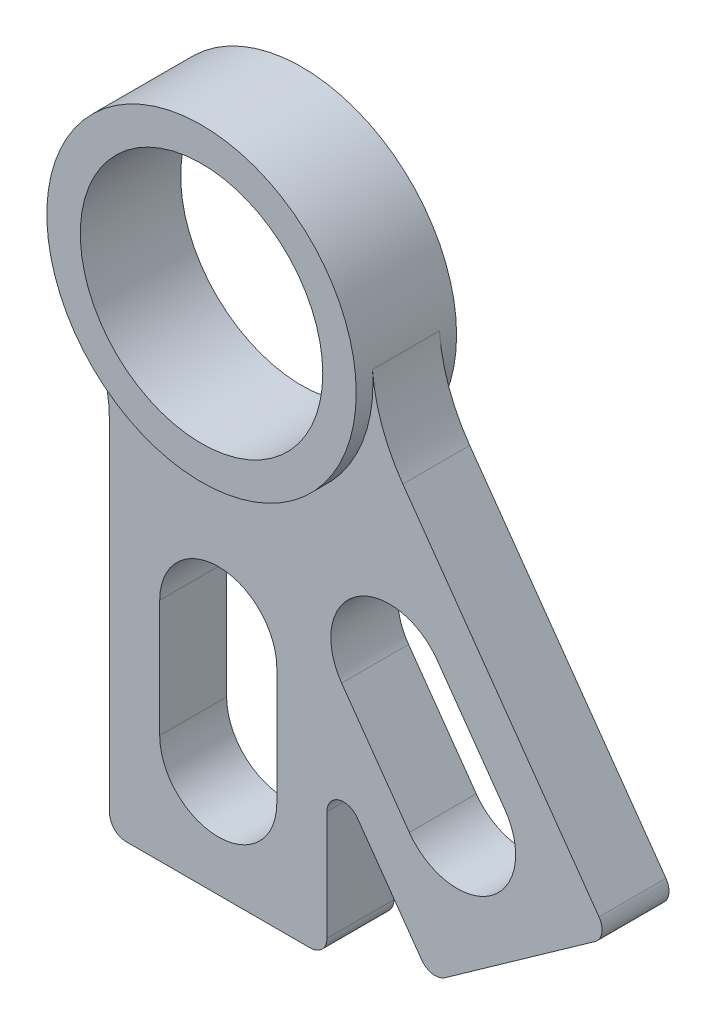
ISO-10303-21;
HEADER;
FILE_DESCRIPTION(('STEP AP214'),'2;1');
FILE_NAME('part.step','',(''),(''),'','','');
FILE_SCHEMA(('AUTOMOTIVE_DESIGN { 1 0 10303 214 1 1 1 1 }'));
ENDSEC;
DATA;
#1=APPLICATION_CONTEXT('core data for automotive mechanical design processes');
#2=APPLICATION_PROTOCOL_DEFINITION('international standard','automotive_design',2000,#1);
#3=PRODUCT_CONTEXT('',#1,'mechanical');
#4=PRODUCT('Part','Part','',(#3));
#5=PRODUCT_RELATED_PRODUCT_CATEGORY('part','',(#4));
#6=PRODUCT_DEFINITION_FORMATION('','',#4);
#7=PRODUCT_DEFINITION_CONTEXT('part definition',#1,'design');
#8=PRODUCT_DEFINITION('design','',#6,#7);
#9=PRODUCT_DEFINITION_SHAPE('','',#8);
#10=(LENGTH_UNIT() NAMED_UNIT(*) SI_UNIT(.MILLI.,.METRE.));
#11=(NAMED_UNIT(*) PLANE_ANGLE_UNIT() SI_UNIT($,.RADIAN.));
#12=(NAMED_UNIT(*) SI_UNIT($,.STERADIAN.) SOLID_ANGLE_UNIT());
#13=UNCERTAINTY_MEASURE_WITH_UNIT(LENGTH_MEASURE(1.E-05),#10,'distance_accuracy_value','');
#14=(GEOMETRIC_REPRESENTATION_CONTEXT(3) GLOBAL_UNCERTAINTY_ASSIGNED_CONTEXT((#13)) GLOBAL_UNIT_ASSIGNED_CONTEXT((#10,
#11,#12)) REPRESENTATION_CONTEXT('',''));
#15=CARTESIAN_POINT('',(0.,0.,0.));
#16=DIRECTION('',(0.,0.,1.));
#17=DIRECTION('',(1.,0.,0.));
#18=AXIS2_PLACEMENT_3D('',#15,#16,#17);
#19=CARTESIAN_POINT('',(0.,-27.9580697939255,-4.7625));
#20=DIRECTION('',(0.,0.,1.));
#21=DIRECTION('',(1.,0.,0.));
#22=AXIS2_PLACEMENT_3D('',#19,#20,#21);
#23=CYLINDRICAL_SURFACE('',#22,5.55624999999843);
#24=CARTESIAN_POINT('',(0.,-27.9580697939255,3.175));
#25=DIRECTION('',(0.,0.,1.));
#26=DIRECTION('',(1.,0.,0.));
#27=AXIS2_PLACEMENT_3D('',#24,#25,#26);
#28=CIRCLE('',#27,5.55624999999843);
#29=CARTESIAN_POINT('',(5.55624999999843,-27.9580697939256,3.175));
#30=VERTEX_POINT('',#29);
#31=CARTESIAN_POINT('',(-5.55624999999845,-27.9580697939256,3.175));
#32=VERTEX_POINT('',#31);
#33=EDGE_CURVE('E343',#30,#32,#28,.T.);
#34=ORIENTED_EDGE('',*,*,#33,.T.);
#35=DIRECTION('',(0.,0.,1.));
#36=VECTOR('',#35,1.);
#37=CARTESIAN_POINT('',(-5.55624999999843,-27.9580697939256,-4.7625));
#38=LINE('',#37,#36);
#39=CARTESIAN_POINT('',(-5.55624999999842,-27.9580697939256,-3.175));
#40=VERTEX_POINT('',#39);
#41=EDGE_CURVE('E242',#40,#32,#38,.T.);
#42=ORIENTED_EDGE('',*,*,#41,.F.);
#43=CARTESIAN_POINT('',(0.,-27.9580697939255,-3.175));
#44=DIRECTION('',(0.,0.,1.));
#45=DIRECTION('',(1.,0.,0.));
#46=AXIS2_PLACEMENT_3D('',#43,#44,#45);
#47=CIRCLE('',#46,5.55624999999843);
#48=CARTESIAN_POINT('',(5.55624999999841,-27.9580697939256,-3.175));
#49=VERTEX_POINT('',#48);
#50=EDGE_CURVE('E381',#49,#40,#47,.T.);
#51=ORIENTED_EDGE('',*,*,#50,.F.);
#52=DIRECTION('',(0.,0.,1.));
#53=VECTOR('',#52,1.);
#54=CARTESIAN_POINT('',(5.55624999999843,-27.9580697939256,-4.7625));
#55=LINE('',#54,#53);
#56=EDGE_CURVE('E213',#49,#30,#55,.T.);
#57=ORIENTED_EDGE('',*,*,#56,.T.);
#58=EDGE_LOOP('',(#34,#42,#51,#57));
#59=FACE_BOUND('',#58,.T.);
#60=ADVANCED_FACE('F39',(#59),#23,.F.);
#61=CARTESIAN_POINT('',(-5.55624999999844,0.,-4.7625));
#62=DIRECTION('',(1.,0.,0.));
#63=DIRECTION('',(0.,1.,0.));
#64=AXIS2_PLACEMENT_3D('',#61,#62,#63);
#65=PLANE('',#64);
#66=ORIENTED_EDGE('',*,*,#41,.T.);
#67=DIRECTION('',(0.,1.,0.));
#68=VECTOR('',#67,1.);
#69=CARTESIAN_POINT('',(-5.55624999999844,0.,3.175));
#70=LINE('',#69,#68);
#71=CARTESIAN_POINT('',(-5.55624999999848,-39.0705697939288,3.175));
#72=VERTEX_POINT('',#71);
#73=EDGE_CURVE('E349',#72,#32,#70,.T.);
#74=ORIENTED_EDGE('',*,*,#73,.F.);
#75=DIRECTION('',(0.,0.,1.));
#76=VECTOR('',#75,1.);
#77=CARTESIAN_POINT('',(-5.55624999999842,-39.0705697939288,-4.7625));
#78=LINE('',#77,#76);
#79=CARTESIAN_POINT('',(-5.55624999999842,-39.0705697939288,-3.175));
#80=VERTEX_POINT('',#79);
#81=EDGE_CURVE('E428',#80,#72,#78,.T.);
#82=ORIENTED_EDGE('',*,*,#81,.F.);
#83=DIRECTION('',(0.,-1.,0.));
#84=VECTOR('',#83,1.);
#85=CARTESIAN_POINT('',(-5.55624999999844,0.,-3.175));
#86=LINE('',#85,#84);
#87=EDGE_CURVE('E384',#40,#80,#86,.T.);
#88=ORIENTED_EDGE('',*,*,#87,.F.);
#89=EDGE_LOOP('',(#66,#74,#82,#88));
#90=FACE_BOUND('',#89,.T.);
#91=ADVANCED_FACE('F427',(#90),#65,.T.);
#92=CARTESIAN_POINT('',(0.,-39.0705697939288,-4.7625));
#93=DIRECTION('',(0.,0.,1.));
#94=DIRECTION('',(1.,0.,0.));
#95=AXIS2_PLACEMENT_3D('',#92,#93,#94);
#96=CYLINDRICAL_SURFACE('',#95,5.55624999999845);
#97=CARTESIAN_POINT('',(0.,-39.0705697939288,3.175));
#98=DIRECTION('',(0.,0.,1.));
#99=DIRECTION('',(1.,0.,0.));
#100=AXIS2_PLACEMENT_3D('',#97,#98,#99);
#101=CIRCLE('',#100,5.55624999999845);
#102=CARTESIAN_POINT('',(5.55624999999842,-39.0705697939288,3.175));
#103=VERTEX_POINT('',#102);
#104=EDGE_CURVE('E352',#72,#103,#101,.T.);
#105=ORIENTED_EDGE('',*,*,#104,.T.);
#106=DIRECTION('',(0.,0.,1.));
#107=VECTOR('',#106,1.);
#108=CARTESIAN_POINT('',(5.55624999999848,-39.0705697939288,-4.7625));
#109=LINE('',#108,#107);
#110=CARTESIAN_POINT('',(5.55624999999848,-39.0705697939288,-3.175));
#111=VERTEX_POINT('',#110);
#112=EDGE_CURVE('E217',#111,#103,#109,.T.);
#113=ORIENTED_EDGE('',*,*,#112,.F.);
#114=CARTESIAN_POINT('',(0.,-39.0705697939288,-3.175));
#115=DIRECTION('',(0.,0.,1.));
#116=DIRECTION('',(1.,0.,0.));
#117=AXIS2_PLACEMENT_3D('',#114,#115,#116);
#118=CIRCLE('',#117,5.55624999999845);
#119=EDGE_CURVE('E378',#80,#111,#118,.T.);
#120=ORIENTED_EDGE('',*,*,#119,.F.);
#121=ORIENTED_EDGE('',*,*,#81,.T.);
#122=EDGE_LOOP('',(#105,#113,#120,#121));
#123=FACE_BOUND('',#122,.T.);
#124=ADVANCED_FACE('F437',(#123),#96,.F.);
#125=CARTESIAN_POINT('',(16.2411710413153,-22.9127804627995,-4.7625));
#126=DIRECTION('',(0.,0.,1.));
#127=DIRECTION('',(1.,0.,0.));
#128=AXIS2_PLACEMENT_3D('',#125,#126,#127);
#129=CYLINDRICAL_SURFACE('',#128,5.55624999999839);
#130=CARTESIAN_POINT('',(16.241171041315,-22.9127804627991,3.175));
#131=DIRECTION('',(0.,0.,1.));
#132=DIRECTION('',(1.,0.,0.));
#133=AXIS2_PLACEMENT_3D('',#130,#131,#132);
#134=CIRCLE('',#133,5.5562499999984);
#135=CARTESIAN_POINT('',(20.7741537748646,-19.6996851327749,3.175));
#136=VERTEX_POINT('',#135);
#137=CARTESIAN_POINT('',(11.7081883077658,-26.1258757928238,3.175));
#138=VERTEX_POINT('',#137);
#139=EDGE_CURVE('E191',#136,#138,#134,.T.);
#140=ORIENTED_EDGE('',*,*,#139,.T.);
#141=DIRECTION('',(0.,0.,1.));
#142=VECTOR('',#141,1.);
#143=CARTESIAN_POINT('',(11.7081883077661,-26.1258757928242,-4.7625));
#144=LINE('',#143,#142);
#145=CARTESIAN_POINT('',(11.7081883077658,-26.1258757928238,-3.175));
#146=VERTEX_POINT('',#145);
#147=EDGE_CURVE('E205',#146,#138,#144,.T.);
#148=ORIENTED_EDGE('',*,*,#147,.F.);
#149=CARTESIAN_POINT('',(16.241171041315,-22.9127804627991,-3.175));
#150=DIRECTION('',(0.,0.,1.));
#151=DIRECTION('',(1.,0.,0.));
#152=AXIS2_PLACEMENT_3D('',#149,#150,#151);
#153=CIRCLE('',#152,5.5562499999984);
#154=CARTESIAN_POINT('',(20.7741537748643,-19.6996851327744,-3.175));
#155=VERTEX_POINT('',#154);
#156=EDGE_CURVE('E371',#155,#146,#153,.T.);
#157=ORIENTED_EDGE('',*,*,#156,.F.);
#158=DIRECTION('',(0.,0.,1.));
#159=VECTOR('',#158,1.);
#160=CARTESIAN_POINT('',(20.7741537748646,-19.6996851327749,-4.7625));
#161=LINE('',#160,#159);
#162=EDGE_CURVE('E207',#155,#136,#161,.T.);
#163=ORIENTED_EDGE('',*,*,#162,.T.);
#164=EDGE_LOOP('',(#140,#148,#157,#163));
#165=FACE_BOUND('',#164,.T.);
#166=ADVANCED_FACE('F203',(#165),#129,.F.);
#167=CARTESIAN_POINT('',(-4.53298273354924,-3.21309533002469,-4.7625));
#168=DIRECTION('',(0.815834912675017,0.578284873795388,0.));
#169=DIRECTION('',(-0.578284873795388,0.815834912675017,0.));
#170=AXIS2_PLACEMENT_3D('',#167,#168,#169);
#171=PLANE('',#170);
#172=ORIENTED_EDGE('',*,*,#147,.T.);
#173=DIRECTION('',(-0.578284873795389,0.815834912675016,0.));
#174=VECTOR('',#173,1.);
#175=CARTESIAN_POINT('',(-4.53298273354926,-3.2130953300247,3.175));
#176=LINE('',#175,#174);
#177=CARTESIAN_POINT('',(18.1343789678189,-35.1918412599276,3.175));
#178=VERTEX_POINT('',#177);
#179=EDGE_CURVE('E188',#178,#138,#176,.T.);
#180=ORIENTED_EDGE('',*,*,#179,.F.);
#181=DIRECTION('',(0.,0.,1.));
#182=VECTOR('',#181,1.);
#183=CARTESIAN_POINT('',(18.1343789678192,-35.191841259928,-4.7625));
#184=LINE('',#183,#182);
#185=CARTESIAN_POINT('',(18.1343789678189,-35.1918412599276,-3.175));
#186=VERTEX_POINT('',#185);
#187=EDGE_CURVE('E214',#186,#178,#184,.T.);
#188=ORIENTED_EDGE('',*,*,#187,.F.);
#189=DIRECTION('',(0.578284873795389,-0.815834912675016,0.));
#190=VECTOR('',#189,1.);
#191=CARTESIAN_POINT('',(-4.53298273354926,-3.2130953300247,-3.175));
#192=LINE('',#191,#190);
#193=EDGE_CURVE('E212',#146,#186,#192,.T.);
#194=ORIENTED_EDGE('',*,*,#193,.F.);
#195=EDGE_LOOP('',(#172,#180,#188,#194));
#196=FACE_BOUND('',#195,.T.);
#197=ADVANCED_FACE('F211',(#196),#171,.T.);
#198=CARTESIAN_POINT('',(22.6673617013684,-31.9787459299033,-4.7625));
#199=DIRECTION('',(0.,0.,1.));
#200=DIRECTION('',(1.,0.,0.));
#201=AXIS2_PLACEMENT_3D('',#198,#199,#200);
#202=CYLINDRICAL_SURFACE('',#201,5.55624999999839);
#203=CARTESIAN_POINT('',(22.6673617013681,-31.9787459299029,3.175));
#204=DIRECTION('',(0.,0.,1.));
#205=DIRECTION('',(1.,0.,0.));
#206=AXIS2_PLACEMENT_3D('',#203,#204,#205);
#207=CIRCLE('',#206,5.5562499999984);
#208=CARTESIAN_POINT('',(27.2003444349174,-28.7656505998782,3.175));
#209=VERTEX_POINT('',#208);
#210=EDGE_CURVE('E194',#178,#209,#207,.T.);
#211=ORIENTED_EDGE('',*,*,#210,.T.);
#212=DIRECTION('',(0.,0.,1.));
#213=VECTOR('',#212,1.);
#214=CARTESIAN_POINT('',(27.2003444349177,-28.7656505998786,-4.7625));
#215=LINE('',#214,#213);
#216=CARTESIAN_POINT('',(27.2003444349177,-28.7656505998786,-3.175));
#217=VERTEX_POINT('',#216);
#218=EDGE_CURVE('E219',#217,#209,#215,.T.);
#219=ORIENTED_EDGE('',*,*,#218,.F.);
#220=CARTESIAN_POINT('',(22.6673617013681,-31.9787459299029,-3.175));
#221=DIRECTION('',(0.,0.,1.));
#222=DIRECTION('',(1.,0.,0.));
#223=AXIS2_PLACEMENT_3D('',#220,#221,#222);
#224=CIRCLE('',#223,5.5562499999984);
#225=EDGE_CURVE('E407',#186,#217,#224,.T.);
#226=ORIENTED_EDGE('',*,*,#225,.F.);
#227=ORIENTED_EDGE('',*,*,#187,.T.);
#228=EDGE_LOOP('',(#211,#219,#226,#227));
#229=FACE_BOUND('',#228,.T.);
#230=ADVANCED_FACE('F461',(#229),#202,.F.);
#231=CARTESIAN_POINT('',(30.4686948801661,2.3108419978967,-4.7625));
#232=DIRECTION('',(0.,0.,1.));
#233=DIRECTION('',(1.,0.,0.));
#234=AXIS2_PLACEMENT_3D('',#231,#232,#233);
#235=CYLINDRICAL_SURFACE('',#234,15.8749999999984);
#236=DIRECTION('',(0.,0.,1.));
#237=VECTOR('',#236,1.);
#238=CARTESIAN_POINT('',(14.6391568085926,1.11027986266364,-4.7625));
#239=LINE('',#238,#237);
#240=CARTESIAN_POINT('',(14.6391568085926,1.11027986266361,-3.175));
#241=VERTEX_POINT('',#240);
#242=CARTESIAN_POINT('',(14.6391568085927,1.11027986266362,3.175));
#243=VERTEX_POINT('',#242);
#244=EDGE_CURVE('E226',#241,#243,#239,.T.);
#245=ORIENTED_EDGE('',*,*,#244,.T.);
#246=CARTESIAN_POINT('',(30.4686948801662,2.31084199789663,3.175));
#247=DIRECTION('',(0.,0.,1.));
#248=DIRECTION('',(1.,0.,0.));
#249=AXIS2_PLACEMENT_3D('',#246,#247,#248);
#250=CIRCLE('',#249,15.8749999999984);
#251=CARTESIAN_POINT('',(17.5173156414516,-6.86943037360423,3.175));
#252=VERTEX_POINT('',#251);
#253=EDGE_CURVE('E358',#243,#252,#250,.T.);
#254=ORIENTED_EDGE('',*,*,#253,.T.);
#255=DIRECTION('',(0.,0.,1.));
#256=VECTOR('',#255,1.);
#257=CARTESIAN_POINT('',(17.5173156414513,-6.86943037360393,-4.7625));
#258=LINE('',#257,#256);
#259=CARTESIAN_POINT('',(17.5173156414515,-6.86943037360424,-3.175));
#260=VERTEX_POINT('',#259);
#261=EDGE_CURVE('E229',#260,#252,#258,.T.);
#262=ORIENTED_EDGE('',*,*,#261,.F.);
#263=CARTESIAN_POINT('',(30.4686948801662,2.31084199789663,-3.175));
#264=DIRECTION('',(0.,0.,1.));
#265=DIRECTION('',(1.,0.,0.));
#266=AXIS2_PLACEMENT_3D('',#263,#264,#265);
#267=CIRCLE('',#266,15.8749999999984);
#268=EDGE_CURVE('E319',#241,#260,#267,.T.);
#269=ORIENTED_EDGE('',*,*,#268,.F.);
#270=EDGE_LOOP('',(#245,#254,#262,#269));
#271=FACE_BOUND('',#270,.T.);
#272=ADVANCED_FACE('F464',(#271),#235,.F.);
#273=CARTESIAN_POINT('',(8.41839650516398,5.96717704147522,-4.7625));
#274=DIRECTION('',(0.815834912675016,0.578284873795389,0.));
#275=DIRECTION('',(-0.578284873795389,0.815834912675016,0.));
#276=AXIS2_PLACEMENT_3D('',#273,#274,#275);
#277=PLANE('',#276);
#278=DIRECTION('',(0.578284873795388,-0.815834912675017,0.));
#279=VECTOR('',#278,1.);
#280=CARTESIAN_POINT('',(8.41839650516403,5.96717704147524,3.175));
#281=LINE('',#280,#279);
#282=CARTESIAN_POINT('',(36.1349080108575,-33.1348274697205,3.175));
#283=VERTEX_POINT('',#282);
#284=EDGE_CURVE('E712',#252,#283,#281,.T.);
#285=ORIENTED_EDGE('',*,*,#284,.T.);
#286=DIRECTION('',(0.,0.,1.));
#287=VECTOR('',#286,1.);
#288=CARTESIAN_POINT('',(36.1349080108575,-33.1348274697204,-4.7625));
#289=LINE('',#288,#287);
#290=CARTESIAN_POINT('',(36.1349080108575,-33.1348274697205,-3.175));
#291=VERTEX_POINT('',#290);
#292=EDGE_CURVE('E263',#283,#291,#289,.F.);
#293=ORIENTED_EDGE('',*,*,#292,.T.);
#294=DIRECTION('',(-0.578284873795388,0.815834912675017,0.));
#295=VECTOR('',#294,1.);
#296=CARTESIAN_POINT('',(8.41839650516403,5.96717704147524,-3.175));
#297=LINE('',#296,#295);
#298=EDGE_CURVE('E317',#291,#260,#297,.T.);
#299=ORIENTED_EDGE('',*,*,#298,.T.);
#300=ORIENTED_EDGE('',*,*,#261,.T.);
#301=EDGE_LOOP('',(#285,#293,#299,#300));
#302=FACE_BOUND('',#301,.T.);
#303=ADVANCED_FACE('F472',(#302),#277,.T.);
#304=CARTESIAN_POINT('',(28.6345387428437,-40.3971424350673,-4.7625));
#305=DIRECTION('',(0.578284873795389,-0.815834912675016,0.));
#306=DIRECTION('',(0.815834912675016,0.578284873795389,0.));
#307=AXIS2_PLACEMENT_3D('',#304,#305,#306);
#308=PLANE('',#307);
#309=DIRECTION('',(0.815834912675017,0.578284873795388,0.));
#310=VECTOR('',#309,1.);
#311=CARTESIAN_POINT('',(28.6345387428433,-40.3971424350669,-3.175));
#312=LINE('',#311,#310);
#313=CARTESIAN_POINT('',(21.5112801615509,-45.4462922393919,-3.175));
#314=VERTEX_POINT('',#313);
#315=CARTESIAN_POINT('',(35.7577973241358,-35.3479926307418,-3.175));
#316=VERTEX_POINT('',#315);
#317=EDGE_CURVE('E309',#314,#316,#312,.T.);
#318=ORIENTED_EDGE('',*,*,#317,.T.);
#319=DIRECTION('',(0.,0.,1.));
#320=VECTOR('',#319,1.);
#321=CARTESIAN_POINT('',(35.757797324136,-35.3479926307422,-4.7625));
#322=LINE('',#321,#320);
#323=CARTESIAN_POINT('',(35.7577973241358,-35.3479926307418,3.175));
#324=VERTEX_POINT('',#323);
#325=EDGE_CURVE('E252',#316,#324,#322,.T.);
#326=ORIENTED_EDGE('',*,*,#325,.T.);
#327=DIRECTION('',(-0.815834912675017,-0.578284873795388,0.));
#328=VECTOR('',#327,1.);
#329=CARTESIAN_POINT('',(28.6345387428433,-40.3971424350669,3.175));
#330=LINE('',#329,#328);
#331=CARTESIAN_POINT('',(21.5112801615509,-45.4462922393919,3.175));
#332=VERTEX_POINT('',#331);
#333=EDGE_CURVE('E294',#324,#332,#330,.T.);
#334=ORIENTED_EDGE('',*,*,#333,.T.);
#335=DIRECTION('',(0.,0.,1.));
#336=VECTOR('',#335,1.);
#337=CARTESIAN_POINT('',(21.5112801615512,-45.4462922393923,-3.175));
#338=LINE('',#337,#336);
#339=EDGE_CURVE('E250',#332,#314,#338,.F.);
#340=ORIENTED_EDGE('',*,*,#339,.T.);
#341=EDGE_LOOP('',(#318,#326,#334,#340));
#342=FACE_BOUND('',#341,.T.);
#343=ADVANCED_FACE('F476',(#342),#308,.T.);
#344=CARTESIAN_POINT('',(-8.418396505164,-5.96717704147522,-4.7625));
#345=DIRECTION('',(0.815834912675017,0.578284873795388,0.));
#346=DIRECTION('',(-0.578284873795388,0.815834912675017,0.));
#347=AXIS2_PLACEMENT_3D('',#344,#345,#346);
#348=PLANE('',#347);
#349=DIRECTION('',(-0.578284873795388,0.815834912675017,0.));
#350=VECTOR('',#349,1.);
#351=CARTESIAN_POINT('',(-8.41839650516401,-5.96717704147522,3.175));
#352=LINE('',#351,#350);
#353=CARTESIAN_POINT('',(19.2981150005294,-45.0691815526709,3.175));
#354=VERTEX_POINT('',#353);
#355=CARTESIAN_POINT('',(13.20138792387,-36.4680179608496,3.175));
#356=VERTEX_POINT('',#355);
#357=EDGE_CURVE('E283',#354,#356,#352,.T.);
#358=ORIENTED_EDGE('',*,*,#357,.T.);
#359=DIRECTION('',(0.,0.,1.));
#360=VECTOR('',#359,1.);
#361=CARTESIAN_POINT('',(13.20138792387,-36.4680179608496,-3.175));
#362=LINE('',#361,#360);
#363=CARTESIAN_POINT('',(13.20138792387,-36.4680179608496,-3.175));
#364=VERTEX_POINT('',#363);
#365=EDGE_CURVE('E248',#356,#364,#362,.F.);
#366=ORIENTED_EDGE('',*,*,#365,.T.);
#367=DIRECTION('',(0.578284873795388,-0.815834912675017,0.));
#368=VECTOR('',#367,1.);
#369=CARTESIAN_POINT('',(-8.41839650516401,-5.96717704147522,-3.175));
#370=LINE('',#369,#368);
#371=CARTESIAN_POINT('',(19.2981150005294,-45.0691815526709,-3.175));
#372=VERTEX_POINT('',#371);
#373=EDGE_CURVE('E303',#364,#372,#370,.T.);
#374=ORIENTED_EDGE('',*,*,#373,.T.);
#375=DIRECTION('',(0.,0.,1.));
#376=VECTOR('',#375,1.);
#377=CARTESIAN_POINT('',(19.2981150005294,-45.0691815526709,3.175));
#378=LINE('',#377,#376);
#379=EDGE_CURVE('E245',#372,#354,#378,.T.);
#380=ORIENTED_EDGE('',*,*,#379,.T.);
#381=EDGE_LOOP('',(#358,#366,#374,#380));
#382=FACE_BOUND('',#381,.T.);
#383=ADVANCED_FACE('F290',(#382),#348,.F.);
#384=CARTESIAN_POINT('',(10.3187499999986,0.,-4.7625));
#385=DIRECTION('',(-1.,0.,0.));
#386=DIRECTION('',(0.,-1.,0.));
#387=AXIS2_PLACEMENT_3D('',#384,#385,#386);
#388=PLANE('',#387);
#389=DIRECTION('',(0.,1.,0.));
#390=VECTOR('',#389,1.);
#391=CARTESIAN_POINT('',(10.3187499999985,0.,-3.175));
#392=LINE('',#391,#390);
#393=CARTESIAN_POINT('',(10.3187499999984,-47.8018197939272,-3.175));
#394=VERTEX_POINT('',#393);
#395=CARTESIAN_POINT('',(10.3187499999984,-37.3860451979998,-3.175));
#396=VERTEX_POINT('',#395);
#397=EDGE_CURVE('E302',#394,#396,#392,.T.);
#398=ORIENTED_EDGE('',*,*,#397,.T.);
#399=DIRECTION('',(0.,0.,1.));
#400=VECTOR('',#399,1.);
#401=CARTESIAN_POINT('',(10.3187499999984,-37.3860451979998,3.175));
#402=LINE('',#401,#400);
#403=CARTESIAN_POINT('',(10.3187499999984,-37.3860451979998,3.175));
#404=VERTEX_POINT('',#403);
#405=EDGE_CURVE('E241',#396,#404,#402,.T.);
#406=ORIENTED_EDGE('',*,*,#405,.T.);
#407=DIRECTION('',(0.,-1.,0.));
#408=VECTOR('',#407,1.);
#409=CARTESIAN_POINT('',(10.3187499999985,0.,3.175));
#410=LINE('',#409,#408);
#411=CARTESIAN_POINT('',(10.3187499999984,-47.8018197939272,3.175));
#412=VERTEX_POINT('',#411);
#413=EDGE_CURVE('E285',#404,#412,#410,.T.);
#414=ORIENTED_EDGE('',*,*,#413,.T.);
#415=DIRECTION('',(0.,0.,1.));
#416=VECTOR('',#415,1.);
#417=CARTESIAN_POINT('',(10.3187499999984,-47.8018197939272,-3.175));
#418=LINE('',#417,#416);
#419=EDGE_CURVE('E239',#412,#394,#418,.F.);
#420=ORIENTED_EDGE('',*,*,#419,.T.);
#421=EDGE_LOOP('',(#398,#406,#414,#420));
#422=FACE_BOUND('',#421,.T.);
#423=ADVANCED_FACE('F305',(#422),#388,.F.);
#424=CARTESIAN_POINT('',(0.,-49.3893197939272,-4.7625));
#425=DIRECTION('',(0.,-1.,0.));
#426=DIRECTION('',(1.,0.,0.));
#427=AXIS2_PLACEMENT_3D('',#424,#425,#426);
#428=PLANE('',#427);
#429=DIRECTION('',(1.,0.,0.));
#430=VECTOR('',#429,1.);
#431=CARTESIAN_POINT('',(0.,-49.3893197939272,-3.175));
#432=LINE('',#431,#430);
#433=CARTESIAN_POINT('',(-8.73124999999842,-49.3893197939272,-3.175));
#434=VERTEX_POINT('',#433);
#435=CARTESIAN_POINT('',(8.73124999999837,-49.3893197939272,-3.175));
#436=VERTEX_POINT('',#435);
#437=EDGE_CURVE('E307',#434,#436,#432,.T.);
#438=ORIENTED_EDGE('',*,*,#437,.T.);
#439=DIRECTION('',(0.,0.,1.));
#440=VECTOR('',#439,1.);
#441=CARTESIAN_POINT('',(8.73124999999837,-49.3893197939272,3.175));
#442=LINE('',#441,#440);
#443=CARTESIAN_POINT('',(8.73124999999837,-49.3893197939272,3.175));
#444=VERTEX_POINT('',#443);
#445=EDGE_CURVE('E273',#436,#444,#442,.T.);
#446=ORIENTED_EDGE('',*,*,#445,.T.);
#447=DIRECTION('',(-1.,0.,0.));
#448=VECTOR('',#447,1.);
#449=CARTESIAN_POINT('',(0.,-49.3893197939272,3.175));
#450=LINE('',#449,#448);
#451=CARTESIAN_POINT('',(-8.73124999999842,-49.3893197939272,3.175));
#452=VERTEX_POINT('',#451);
#453=EDGE_CURVE('E396',#444,#452,#450,.T.);
#454=ORIENTED_EDGE('',*,*,#453,.T.);
#455=DIRECTION('',(0.,0.,1.));
#456=VECTOR('',#455,1.);
#457=CARTESIAN_POINT('',(-8.73124999999842,-49.3893197939272,-4.7625));
#458=LINE('',#457,#456);
#459=EDGE_CURVE('E61',#452,#434,#458,.F.);
#460=ORIENTED_EDGE('',*,*,#459,.T.);
#461=EDGE_LOOP('',(#438,#446,#454,#460));
#462=FACE_BOUND('',#461,.T.);
#463=ADVANCED_FACE('F399',(#462),#428,.T.);
#464=CARTESIAN_POINT('',(-10.3187499999984,0.,-4.7625));
#465=DIRECTION('',(-1.,0.,0.));
#466=DIRECTION('',(0.,-1.,0.));
#467=AXIS2_PLACEMENT_3D('',#464,#465,#466);
#468=PLANE('',#467);
#469=DIRECTION('',(0.,-1.,0.));
#470=VECTOR('',#469,1.);
#471=CARTESIAN_POINT('',(-10.3187499999984,0.,-3.175));
#472=LINE('',#471,#470);
#473=CARTESIAN_POINT('',(-10.3187499999984,-15.7343197939272,-3.175));
#474=VERTEX_POINT('',#473);
#475=CARTESIAN_POINT('',(-10.3187499999984,-47.8018197939272,-3.175));
#476=VERTEX_POINT('',#475);
#477=EDGE_CURVE('E311',#474,#476,#472,.T.);
#478=ORIENTED_EDGE('',*,*,#477,.T.);
#479=DIRECTION('',(0.,0.,1.));
#480=VECTOR('',#479,1.);
#481=CARTESIAN_POINT('',(-10.3187499999984,-47.8018197939272,-4.7625));
#482=LINE('',#481,#480);
#483=CARTESIAN_POINT('',(-10.3187499999984,-47.8018197939272,3.175));
#484=VERTEX_POINT('',#483);
#485=EDGE_CURVE('E276',#476,#484,#482,.T.);
#486=ORIENTED_EDGE('',*,*,#485,.T.);
#487=DIRECTION('',(0.,1.,0.));
#488=VECTOR('',#487,1.);
#489=CARTESIAN_POINT('',(-10.3187499999984,0.,3.175));
#490=LINE('',#489,#488);
#491=CARTESIAN_POINT('',(-10.3187499999984,-15.7343197939272,3.175));
#492=VERTEX_POINT('',#491);
#493=EDGE_CURVE('E398',#484,#492,#490,.T.);
#494=ORIENTED_EDGE('',*,*,#493,.T.);
#495=DIRECTION('',(0.,0.,1.));
#496=VECTOR('',#495,1.);
#497=CARTESIAN_POINT('',(-10.3187499999984,-15.7343197939272,-4.7625));
#498=LINE('',#497,#496);
#499=EDGE_CURVE('E232',#474,#492,#498,.T.);
#500=ORIENTED_EDGE('',*,*,#499,.F.);
#501=EDGE_LOOP('',(#478,#486,#494,#500));
#502=FACE_BOUND('',#501,.T.);
#503=ADVANCED_FACE('F389',(#502),#468,.T.);
#504=CARTESIAN_POINT('',(4.53298273354925,3.2130953300247,-4.7625));
#505=DIRECTION('',(0.815834912675017,0.578284873795388,0.));
#506=DIRECTION('',(-0.578284873795388,0.815834912675017,0.));
#507=AXIS2_PLACEMENT_3D('',#504,#505,#506);
#508=PLANE('',#507);
#509=DIRECTION('',(0.578284873795388,-0.815834912675017,0.));
#510=VECTOR('',#509,1.);
#511=CARTESIAN_POINT('',(4.53298273354925,3.2130953300247,3.175));
#512=LINE('',#511,#510);
#513=EDGE_CURVE('E208',#136,#209,#512,.T.);
#514=ORIENTED_EDGE('',*,*,#513,.F.);
#515=ORIENTED_EDGE('',*,*,#162,.F.);
#516=DIRECTION('',(-0.578284873795388,0.815834912675017,0.));
#517=VECTOR('',#516,1.);
#518=CARTESIAN_POINT('',(4.53298273354925,3.2130953300247,-3.175));
#519=LINE('',#518,#517);
#520=EDGE_CURVE('E375',#217,#155,#519,.T.);
#521=ORIENTED_EDGE('',*,*,#520,.F.);
#522=ORIENTED_EDGE('',*,*,#218,.T.);
#523=EDGE_LOOP('',(#514,#515,#521,#522));
#524=FACE_BOUND('',#523,.T.);
#525=ADVANCED_FACE('F413',(#524),#508,.F.);
#526=CARTESIAN_POINT('',(-26.1937499999968,-15.7343197939272,-4.7625));
#527=DIRECTION('',(0.,0.,1.));
#528=DIRECTION('',(1.,0.,0.));
#529=AXIS2_PLACEMENT_3D('',#526,#527,#528);
#530=CYLINDRICAL_SURFACE('',#529,15.8749999999984);
#531=CARTESIAN_POINT('',(-26.1937499999968,-15.7343197939272,3.175));
#532=DIRECTION('',(0.,0.,1.));
#533=DIRECTION('',(1.,0.,0.));
#534=AXIS2_PLACEMENT_3D('',#531,#532,#533);
#535=CIRCLE('',#534,15.8749999999984);
#536=CARTESIAN_POINT('',(-12.585193266832,-7.55979787272684,3.175));
#537=VERTEX_POINT('',#536);
#538=EDGE_CURVE('E402',#492,#537,#535,.T.);
#539=ORIENTED_EDGE('',*,*,#538,.T.);
#540=DIRECTION('',(0.,0.,1.));
#541=VECTOR('',#540,1.);
#542=CARTESIAN_POINT('',(-12.5851932668321,-7.55979787272684,-4.7625));
#543=LINE('',#542,#541);
#544=CARTESIAN_POINT('',(-12.585193266832,-7.55979787272684,-3.175));
#545=VERTEX_POINT('',#544);
#546=EDGE_CURVE('E235',#545,#537,#543,.T.);
#547=ORIENTED_EDGE('',*,*,#546,.F.);
#548=CARTESIAN_POINT('',(-26.1937499999968,-15.7343197939272,-3.175));
#549=DIRECTION('',(0.,0.,1.));
#550=DIRECTION('',(1.,0.,0.));
#551=AXIS2_PLACEMENT_3D('',#548,#549,#550);
#552=CIRCLE('',#551,15.8749999999984);
#553=EDGE_CURVE('E325',#474,#545,#552,.T.);
#554=ORIENTED_EDGE('',*,*,#553,.F.);
#555=ORIENTED_EDGE('',*,*,#499,.T.);
#556=EDGE_LOOP('',(#539,#547,#554,#555));
#557=FACE_BOUND('',#556,.T.);
#558=ADVANCED_FACE('F467',(#557),#530,.F.);
#559=CARTESIAN_POINT('',(5.55624999999831,0.,-4.7625));
#560=DIRECTION('',(1.,0.,0.));
#561=DIRECTION('',(0.,1.,0.));
#562=AXIS2_PLACEMENT_3D('',#559,#560,#561);
#563=PLANE('',#562);
#564=DIRECTION('',(0.,-1.,0.));
#565=VECTOR('',#564,1.);
#566=CARTESIAN_POINT('',(5.55624999999831,0.,3.175));
#567=LINE('',#566,#565);
#568=EDGE_CURVE('E348',#30,#103,#567,.T.);
#569=ORIENTED_EDGE('',*,*,#568,.F.);
#570=ORIENTED_EDGE('',*,*,#56,.F.);
#571=DIRECTION('',(0.,1.,0.));
#572=VECTOR('',#571,1.);
#573=CARTESIAN_POINT('',(5.55624999999831,0.,-3.175));
#574=LINE('',#573,#572);
#575=EDGE_CURVE('E380',#111,#49,#574,.T.);
#576=ORIENTED_EDGE('',*,*,#575,.F.);
#577=ORIENTED_EDGE('',*,*,#112,.T.);
#578=EDGE_LOOP('',(#569,#570,#576,#577));
#579=FACE_BOUND('',#578,.T.);
#580=ADVANCED_FACE('F434',(#579),#563,.F.);
#581=CARTESIAN_POINT('',(0.,0.,4.7625));
#582=DIRECTION('',(0.,0.,1.));
#583=DIRECTION('',(1.,0.,0.));
#584=AXIS2_PLACEMENT_3D('',#581,#582,#583);
#585=PLANE('',#584);
#586=CARTESIAN_POINT('',(0.,0.,4.7625));
#587=DIRECTION('',(0.,0.,1.));
#588=DIRECTION('',(1.,0.,0.));
#589=AXIS2_PLACEMENT_3D('',#586,#587,#588);
#590=CIRCLE('',#589,11.5062);
#591=CARTESIAN_POINT('',(11.5062,0.,4.7625));
#592=VERTEX_POINT('',#591);
#593=EDGE_CURVE('E693',#592,#592,#590,.T.);
#594=ORIENTED_EDGE('',*,*,#593,.F.);
#595=EDGE_LOOP('',(#594));
#596=FACE_BOUND('',#595,.T.);
#597=CARTESIAN_POINT('',(0.,0.,4.7625));
#598=DIRECTION('',(0.,0.,1.));
#599=DIRECTION('',(1.,0.,0.));
#600=AXIS2_PLACEMENT_3D('',#597,#598,#599);
#601=CIRCLE('',#600,14.6812);
#602=CARTESIAN_POINT('',(14.6812,0.,4.7625));
#603=VERTEX_POINT('',#602);
#604=EDGE_CURVE('E367',#603,#603,#601,.T.);
#605=ORIENTED_EDGE('',*,*,#604,.T.);
#606=EDGE_LOOP('',(#605));
#607=FACE_BOUND('',#606,.T.);
#608=ADVANCED_FACE('F495',(#596,#607),#585,.T.);
#609=CARTESIAN_POINT('',(0.,0.,-4.7625));
#610=DIRECTION('',(0.,0.,1.));
#611=DIRECTION('',(1.,0.,0.));
#612=AXIS2_PLACEMENT_3D('',#609,#610,#611);
#613=CYLINDRICAL_SURFACE('',#612,14.6812);
#614=ORIENTED_EDGE('',*,*,#604,.F.);
#615=EDGE_LOOP('',(#614));
#616=FACE_BOUND('',#615,.T.);
#617=ORIENTED_EDGE('',*,*,#244,.F.);
#618=CARTESIAN_POINT('',(0.,0.,-3.175));
#619=DIRECTION('',(0.,0.,1.));
#620=DIRECTION('',(1.,0.,0.));
#621=AXIS2_PLACEMENT_3D('',#618,#619,#620);
#622=CIRCLE('',#621,14.6812);
#623=EDGE_CURVE('E322',#545,#241,#622,.T.);
#624=ORIENTED_EDGE('',*,*,#623,.F.);
#625=ORIENTED_EDGE('',*,*,#546,.T.);
#626=CARTESIAN_POINT('',(0.,0.,3.175));
#627=DIRECTION('',(0.,0.,1.));
#628=DIRECTION('',(1.,0.,0.));
#629=AXIS2_PLACEMENT_3D('',#626,#627,#628);
#630=CIRCLE('',#629,14.6812);
#631=EDGE_CURVE('E354',#537,#243,#630,.T.);
#632=ORIENTED_EDGE('',*,*,#631,.T.);
#633=EDGE_LOOP('',(#617,#624,#625,#632));
#634=FACE_BOUND('',#633,.T.);
#635=CARTESIAN_POINT('',(0.,0.,-4.7625));
#636=DIRECTION('',(0.,0.,1.));
#637=DIRECTION('',(1.,0.,0.));
#638=AXIS2_PLACEMENT_3D('',#635,#636,#637);
#639=CIRCLE('',#638,14.6812);
#640=CARTESIAN_POINT('',(14.6812,0.,-4.7625));
#641=VERTEX_POINT('',#640);
#642=EDGE_CURVE('E238',#641,#641,#639,.T.);
#643=ORIENTED_EDGE('',*,*,#642,.T.);
#644=EDGE_LOOP('',(#643));
#645=FACE_BOUND('',#644,.T.);
#646=ADVANCED_FACE('F492',(#616,#634,#645),#613,.T.);
#647=CARTESIAN_POINT('',(0.,0.,-4.7625));
#648=DIRECTION('',(0.,0.,1.));
#649=DIRECTION('',(1.,0.,0.));
#650=AXIS2_PLACEMENT_3D('',#647,#648,#649);
#651=CYLINDRICAL_SURFACE('',#650,11.5062);
#652=CARTESIAN_POINT('',(0.,0.,-4.7625));
#653=DIRECTION('',(0.,0.,1.));
#654=DIRECTION('',(1.,0.,0.));
#655=AXIS2_PLACEMENT_3D('',#652,#653,#654);
#656=CIRCLE('',#655,11.5062);
#657=CARTESIAN_POINT('',(11.5062,0.,-4.7625));
#658=VERTEX_POINT('',#657);
#659=EDGE_CURVE('E362',#658,#658,#656,.T.);
#660=ORIENTED_EDGE('',*,*,#659,.F.);
#661=EDGE_LOOP('',(#660));
#662=FACE_BOUND('',#661,.T.);
#663=ORIENTED_EDGE('',*,*,#593,.T.);
#664=EDGE_LOOP('',(#663));
#665=FACE_BOUND('',#664,.T.);
#666=ADVANCED_FACE('F446',(#662,#665),#651,.F.);
#667=CARTESIAN_POINT('',(0.,0.,-4.7625));
#668=DIRECTION('',(0.,0.,1.));
#669=DIRECTION('',(1.,0.,0.));
#670=AXIS2_PLACEMENT_3D('',#667,#668,#669);
#671=PLANE('',#670);
#672=ORIENTED_EDGE('',*,*,#659,.T.);
#673=EDGE_LOOP('',(#672));
#674=FACE_BOUND('',#673,.T.);
#675=ORIENTED_EDGE('',*,*,#642,.F.);
#676=EDGE_LOOP('',(#675));
#677=FACE_BOUND('',#676,.T.);
#678=ADVANCED_FACE('F439',(#674,#677),#671,.F.);
#679=CARTESIAN_POINT('',(30.4686948801662,2.31084199789663,-3.175));
#680=DIRECTION('',(0.,0.,1.));
#681=DIRECTION('',(1.,0.,0.));
#682=AXIS2_PLACEMENT_3D('',#679,#680,#681);
#683=PLANE('',#682);
#684=ORIENTED_EDGE('',*,*,#298,.F.);
#685=CARTESIAN_POINT('',(34.8397700869859,-34.0528547068706,-3.175));
#686=DIRECTION('',(0.,0.,1.));
#687=DIRECTION('',(1.,0.,0.));
#688=AXIS2_PLACEMENT_3D('',#685,#686,#687);
#689=CIRCLE('',#688,1.5875);
#690=EDGE_CURVE('E270',#291,#316,#689,.F.);
#691=ORIENTED_EDGE('',*,*,#690,.T.);
#692=ORIENTED_EDGE('',*,*,#317,.F.);
#693=CARTESIAN_POINT('',(20.593252924401,-44.1511543155208,-3.175));
#694=DIRECTION('',(0.,0.,1.));
#695=DIRECTION('',(1.,0.,0.));
#696=AXIS2_PLACEMENT_3D('',#693,#694,#695);
#697=CIRCLE('',#696,1.5875);
#698=EDGE_CURVE('E268',#314,#372,#697,.F.);
#699=ORIENTED_EDGE('',*,*,#698,.T.);
#700=ORIENTED_EDGE('',*,*,#373,.F.);
#701=CARTESIAN_POINT('',(11.9062499999984,-37.3860451979998,-3.175));
#702=DIRECTION('',(0.,0.,1.));
#703=DIRECTION('',(1.,0.,0.));
#704=AXIS2_PLACEMENT_3D('',#701,#702,#703);
#705=CIRCLE('',#704,1.5875);
#706=EDGE_CURVE('E12',#364,#396,#705,.T.);
#707=ORIENTED_EDGE('',*,*,#706,.T.);
#708=ORIENTED_EDGE('',*,*,#397,.F.);
#709=CARTESIAN_POINT('',(8.73124999999837,-47.8018197939272,-3.175));
#710=DIRECTION('',(0.,0.,1.));
#711=DIRECTION('',(1.,0.,0.));
#712=AXIS2_PLACEMENT_3D('',#709,#710,#711);
#713=CIRCLE('',#712,1.5875);
#714=EDGE_CURVE('E54',#394,#436,#713,.F.);
#715=ORIENTED_EDGE('',*,*,#714,.T.);
#716=ORIENTED_EDGE('',*,*,#437,.F.);
#717=CARTESIAN_POINT('',(-8.73124999999842,-47.8018197939272,-3.175));
#718=DIRECTION('',(0.,0.,1.));
#719=DIRECTION('',(1.,0.,0.));
#720=AXIS2_PLACEMENT_3D('',#717,#718,#719);
#721=CIRCLE('',#720,1.5875);
#722=EDGE_CURVE('E265',#434,#476,#721,.F.);
#723=ORIENTED_EDGE('',*,*,#722,.T.);
#724=ORIENTED_EDGE('',*,*,#477,.F.);
#725=ORIENTED_EDGE('',*,*,#553,.T.);
#726=ORIENTED_EDGE('',*,*,#623,.T.);
#727=ORIENTED_EDGE('',*,*,#268,.T.);
#728=EDGE_LOOP('',(#684,#691,#692,#699,#700,#707,#708,#715,#716,#723,#724,#725,#726,#727));
#729=FACE_BOUND('',#728,.T.);
#730=ORIENTED_EDGE('',*,*,#575,.T.);
#731=ORIENTED_EDGE('',*,*,#50,.T.);
#732=ORIENTED_EDGE('',*,*,#87,.T.);
#733=ORIENTED_EDGE('',*,*,#119,.T.);
#734=EDGE_LOOP('',(#730,#731,#732,#733));
#735=FACE_BOUND('',#734,.T.);
#736=ORIENTED_EDGE('',*,*,#520,.T.);
#737=ORIENTED_EDGE('',*,*,#156,.T.);
#738=ORIENTED_EDGE('',*,*,#193,.T.);
#739=ORIENTED_EDGE('',*,*,#225,.T.);
#740=EDGE_LOOP('',(#736,#737,#738,#739));
#741=FACE_BOUND('',#740,.T.);
#742=ADVANCED_FACE('F300',(#729,#735,#741),#683,.F.);
#743=CARTESIAN_POINT('',(0.,0.,3.175));
#744=DIRECTION('',(0.,0.,1.));
#745=DIRECTION('',(1.,0.,0.));
#746=AXIS2_PLACEMENT_3D('',#743,#744,#745);
#747=PLANE('',#746);
#748=ORIENTED_EDGE('',*,*,#73,.T.);
#749=ORIENTED_EDGE('',*,*,#33,.F.);
#750=ORIENTED_EDGE('',*,*,#568,.T.);
#751=ORIENTED_EDGE('',*,*,#104,.F.);
#752=EDGE_LOOP('',(#748,#749,#750,#751));
#753=FACE_BOUND('',#752,.T.);
#754=ORIENTED_EDGE('',*,*,#333,.F.);
#755=CARTESIAN_POINT('',(34.8397700869859,-34.0528547068706,3.175));
#756=DIRECTION('',(0.,0.,1.));
#757=DIRECTION('',(1.,0.,0.));
#758=AXIS2_PLACEMENT_3D('',#755,#756,#757);
#759=CIRCLE('',#758,1.5875);
#760=EDGE_CURVE('E261',#324,#283,#759,.T.);
#761=ORIENTED_EDGE('',*,*,#760,.T.);
#762=ORIENTED_EDGE('',*,*,#284,.F.);
#763=ORIENTED_EDGE('',*,*,#253,.F.);
#764=ORIENTED_EDGE('',*,*,#631,.F.);
#765=ORIENTED_EDGE('',*,*,#538,.F.);
#766=ORIENTED_EDGE('',*,*,#493,.F.);
#767=CARTESIAN_POINT('',(-8.73124999999842,-47.8018197939272,3.175));
#768=DIRECTION('',(0.,0.,1.));
#769=DIRECTION('',(1.,0.,0.));
#770=AXIS2_PLACEMENT_3D('',#767,#768,#769);
#771=CIRCLE('',#770,1.5875);
#772=EDGE_CURVE('E255',#484,#452,#771,.T.);
#773=ORIENTED_EDGE('',*,*,#772,.T.);
#774=ORIENTED_EDGE('',*,*,#453,.F.);
#775=CARTESIAN_POINT('',(8.73124999999837,-47.8018197939272,3.175));
#776=DIRECTION('',(0.,0.,1.));
#777=DIRECTION('',(1.,0.,0.));
#778=AXIS2_PLACEMENT_3D('',#775,#776,#777);
#779=CIRCLE('',#778,1.5875);
#780=EDGE_CURVE('E257',#444,#412,#779,.T.);
#781=ORIENTED_EDGE('',*,*,#780,.T.);
#782=ORIENTED_EDGE('',*,*,#413,.F.);
#783=CARTESIAN_POINT('',(11.9062499999984,-37.3860451979998,3.175));
#784=DIRECTION('',(0.,0.,1.));
#785=DIRECTION('',(1.,0.,0.));
#786=AXIS2_PLACEMENT_3D('',#783,#784,#785);
#787=CIRCLE('',#786,1.5875);
#788=EDGE_CURVE('E47',#404,#356,#787,.F.);
#789=ORIENTED_EDGE('',*,*,#788,.T.);
#790=ORIENTED_EDGE('',*,*,#357,.F.);
#791=CARTESIAN_POINT('',(20.593252924401,-44.1511543155208,3.175));
#792=DIRECTION('',(0.,0.,1.));
#793=DIRECTION('',(1.,0.,0.));
#794=AXIS2_PLACEMENT_3D('',#791,#792,#793);
#795=CIRCLE('',#794,1.5875);
#796=EDGE_CURVE('E259',#354,#332,#795,.T.);
#797=ORIENTED_EDGE('',*,*,#796,.T.);
#798=EDGE_LOOP('',(#754,#761,#762,#763,#764,#765,#766,#773,#774,#781,#782,#789,#790,#797));
#799=FACE_BOUND('',#798,.T.);
#800=ORIENTED_EDGE('',*,*,#179,.T.);
#801=ORIENTED_EDGE('',*,*,#139,.F.);
#802=ORIENTED_EDGE('',*,*,#513,.T.);
#803=ORIENTED_EDGE('',*,*,#210,.F.);
#804=EDGE_LOOP('',(#800,#801,#802,#803));
#805=FACE_BOUND('',#804,.T.);
#806=ADVANCED_FACE('F190',(#753,#799,#805),#747,.T.);
#807=CARTESIAN_POINT('',(11.9062499999984,-37.3860451979998,-4.7625));
#808=DIRECTION('',(0.,0.,-1.));
#809=DIRECTION('',(-1.,0.,0.));
#810=AXIS2_PLACEMENT_3D('',#807,#808,#809);
#811=CYLINDRICAL_SURFACE('',#810,1.5875);
#812=ORIENTED_EDGE('',*,*,#706,.F.);
#813=ORIENTED_EDGE('',*,*,#365,.F.);
#814=ORIENTED_EDGE('',*,*,#788,.F.);
#815=ORIENTED_EDGE('',*,*,#405,.F.);
#816=EDGE_LOOP('',(#812,#813,#814,#815));
#817=FACE_BOUND('',#816,.T.);
#818=ADVANCED_FACE('F297',(#817),#811,.F.);
#819=CARTESIAN_POINT('',(34.8397700869859,-34.0528547068706,-4.7625));
#820=DIRECTION('',(0.,0.,1.));
#821=DIRECTION('',(1.,0.,0.));
#822=AXIS2_PLACEMENT_3D('',#819,#820,#821);
#823=CYLINDRICAL_SURFACE('',#822,1.5875);
#824=ORIENTED_EDGE('',*,*,#690,.F.);
#825=ORIENTED_EDGE('',*,*,#292,.F.);
#826=ORIENTED_EDGE('',*,*,#760,.F.);
#827=ORIENTED_EDGE('',*,*,#325,.F.);
#828=EDGE_LOOP('',(#824,#825,#826,#827));
#829=FACE_BOUND('',#828,.T.);
#830=ADVANCED_FACE('F502',(#829),#823,.T.);
#831=CARTESIAN_POINT('',(20.593252924401,-44.1511543155208,-4.7625));
#832=DIRECTION('',(0.,0.,-1.));
#833=DIRECTION('',(-1.,0.,0.));
#834=AXIS2_PLACEMENT_3D('',#831,#832,#833);
#835=CYLINDRICAL_SURFACE('',#834,1.5875);
#836=ORIENTED_EDGE('',*,*,#698,.F.);
#837=ORIENTED_EDGE('',*,*,#339,.F.);
#838=ORIENTED_EDGE('',*,*,#796,.F.);
#839=ORIENTED_EDGE('',*,*,#379,.F.);
#840=EDGE_LOOP('',(#836,#837,#838,#839));
#841=FACE_BOUND('',#840,.T.);
#842=ADVANCED_FACE('F505',(#841),#835,.T.);
#843=CARTESIAN_POINT('',(8.73124999999837,-47.8018197939272,-4.7625));
#844=DIRECTION('',(0.,0.,-1.));
#845=DIRECTION('',(-1.,0.,0.));
#846=AXIS2_PLACEMENT_3D('',#843,#844,#845);
#847=CYLINDRICAL_SURFACE('',#846,1.5875);
#848=ORIENTED_EDGE('',*,*,#714,.F.);
#849=ORIENTED_EDGE('',*,*,#419,.F.);
#850=ORIENTED_EDGE('',*,*,#780,.F.);
#851=ORIENTED_EDGE('',*,*,#445,.F.);
#852=EDGE_LOOP('',(#848,#849,#850,#851));
#853=FACE_BOUND('',#852,.T.);
#854=ADVANCED_FACE('F508',(#853),#847,.T.);
#855=CARTESIAN_POINT('',(-8.73124999999842,-47.8018197939272,-4.7625));
#856=DIRECTION('',(0.,0.,1.));
#857=DIRECTION('',(1.,0.,0.));
#858=AXIS2_PLACEMENT_3D('',#855,#856,#857);
#859=CYLINDRICAL_SURFACE('',#858,1.5875);
#860=ORIENTED_EDGE('',*,*,#722,.F.);
#861=ORIENTED_EDGE('',*,*,#459,.F.);
#862=ORIENTED_EDGE('',*,*,#772,.F.);
#863=ORIENTED_EDGE('',*,*,#485,.F.);
#864=EDGE_LOOP('',(#860,#861,#862,#863));
#865=FACE_BOUND('',#864,.T.);
#866=ADVANCED_FACE('F41',(#865),#859,.T.);
#867=CLOSED_SHELL('',(#60,#91,#124,#166,#197,#230,#272,#303,#343,#383,#423,#463,#503,#525,#558,
#580,#608,#646,#666,#678,#742,#806,#818,#830,#842,#854,#866));
#868=MANIFOLD_SOLID_BREP('B2',#867);
#869=ADVANCED_BREP_SHAPE_REPRESENTATION('',(#18,#868),#14);
#870=SHAPE_DEFINITION_REPRESENTATION(#9,#869);
ENDSEC;
END-ISO-10303-21;
